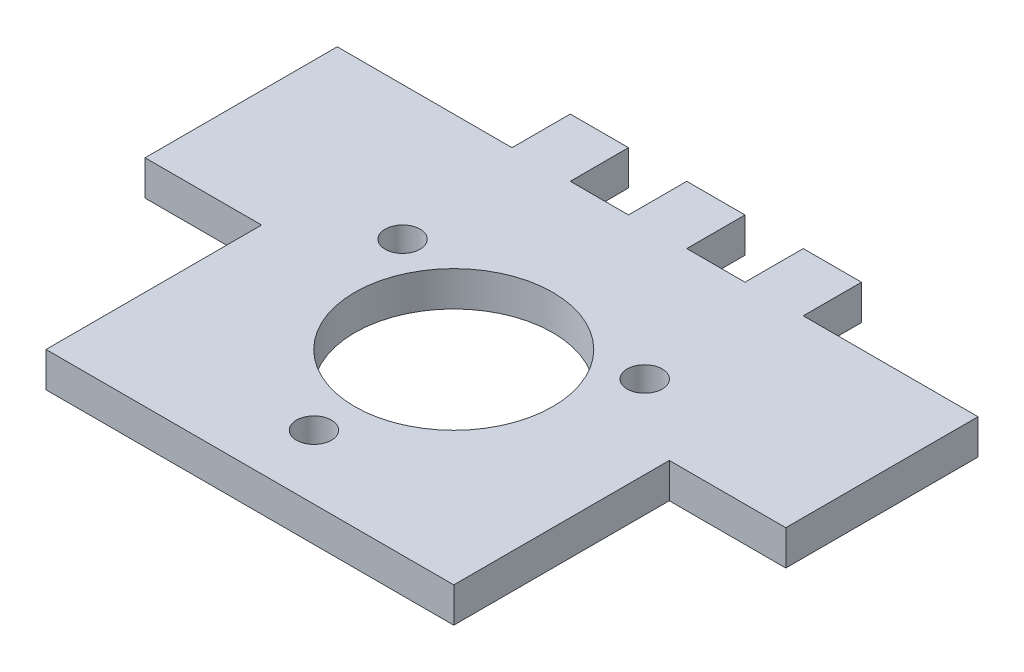
ISO-10303-21;
HEADER;
FILE_DESCRIPTION(('STEP AP214'),'2;1');
FILE_NAME('part.step','',(''),(''),'','','');
FILE_SCHEMA(('AUTOMOTIVE_DESIGN { 1 0 10303 214 1 1 1 1 }'));
ENDSEC;
DATA;
#1=APPLICATION_CONTEXT('core data for automotive mechanical design processes');
#2=APPLICATION_PROTOCOL_DEFINITION('international standard','automotive_design',2000,#1);
#3=PRODUCT_CONTEXT('',#1,'mechanical');
#4=PRODUCT('Part','Part','',(#3));
#5=PRODUCT_RELATED_PRODUCT_CATEGORY('part','',(#4));
#6=PRODUCT_DEFINITION_FORMATION('','',#4);
#7=PRODUCT_DEFINITION_CONTEXT('part definition',#1,'design');
#8=PRODUCT_DEFINITION('design','',#6,#7);
#9=PRODUCT_DEFINITION_SHAPE('','',#8);
#10=(LENGTH_UNIT() NAMED_UNIT(*) SI_UNIT(.MILLI.,.METRE.));
#11=(NAMED_UNIT(*) PLANE_ANGLE_UNIT() SI_UNIT($,.RADIAN.));
#12=(NAMED_UNIT(*) SI_UNIT($,.STERADIAN.) SOLID_ANGLE_UNIT());
#13=UNCERTAINTY_MEASURE_WITH_UNIT(LENGTH_MEASURE(1.E-05),#10,'distance_accuracy_value','');
#14=(GEOMETRIC_REPRESENTATION_CONTEXT(3) GLOBAL_UNCERTAINTY_ASSIGNED_CONTEXT((#13)) GLOBAL_UNIT_ASSIGNED_CONTEXT((#10,
#11,#12)) REPRESENTATION_CONTEXT('',''));
#15=CARTESIAN_POINT('',(0.,0.,0.));
#16=DIRECTION('',(0.,0.,1.));
#17=DIRECTION('',(1.,0.,0.));
#18=AXIS2_PLACEMENT_3D('',#15,#16,#17);
#19=CARTESIAN_POINT('',(-17.5,3.,-17.5));
#20=DIRECTION('',(1.,0.,0.));
#21=DIRECTION('',(0.,0.,-1.));
#22=AXIS2_PLACEMENT_3D('',#19,#20,#21);
#23=PLANE('',#22);
#24=DIRECTION('',(0.,1.,0.));
#25=VECTOR('',#24,1.);
#26=CARTESIAN_POINT('',(-17.5,-19.2937813815747,-0.999999999999997));
#27=LINE('',#26,#25);
#28=CARTESIAN_POINT('',(-17.5,0.,-0.999999999999997));
#29=VERTEX_POINT('',#28);
#30=CARTESIAN_POINT('',(-17.5,3.,-0.999999999999997));
#31=VERTEX_POINT('',#30);
#32=EDGE_CURVE('E56',#29,#31,#27,.T.);
#33=ORIENTED_EDGE('',*,*,#32,.F.);
#34=DIRECTION('',(0.,0.,1.));
#35=VECTOR('',#34,1.);
#36=CARTESIAN_POINT('',(-17.5,0.,-17.5));
#37=LINE('',#36,#35);
#38=CARTESIAN_POINT('',(-17.5,0.,17.5));
#39=VERTEX_POINT('',#38);
#40=EDGE_CURVE('E292',#29,#39,#37,.T.);
#41=ORIENTED_EDGE('',*,*,#40,.T.);
#42=DIRECTION('',(0.,-1.,0.));
#43=VECTOR('',#42,1.);
#44=CARTESIAN_POINT('',(-17.5,3.,17.5));
#45=LINE('',#44,#43);
#46=CARTESIAN_POINT('',(-17.5,3.,17.5));
#47=VERTEX_POINT('',#46);
#48=EDGE_CURVE('E11',#47,#39,#45,.T.);
#49=ORIENTED_EDGE('',*,*,#48,.F.);
#50=DIRECTION('',(0.,0.,1.));
#51=VECTOR('',#50,1.);
#52=CARTESIAN_POINT('',(-17.5,3.,-17.5));
#53=LINE('',#52,#51);
#54=EDGE_CURVE('E218',#31,#47,#53,.T.);
#55=ORIENTED_EDGE('',*,*,#54,.F.);
#56=EDGE_LOOP('',(#33,#41,#49,#55));
#57=FACE_BOUND('',#56,.T.);
#58=ADVANCED_FACE('F32',(#57),#23,.F.);
#59=CARTESIAN_POINT('',(-17.5,3.,-17.5));
#60=DIRECTION('',(0.,0.,1.));
#61=DIRECTION('',(1.,0.,0.));
#62=AXIS2_PLACEMENT_3D('',#59,#60,#61);
#63=PLANE('',#62);
#64=DIRECTION('',(-1.,0.,0.));
#65=VECTOR('',#64,1.);
#66=CARTESIAN_POINT('',(-17.5,3.,-17.5));
#67=LINE('',#66,#65);
#68=CARTESIAN_POINT('',(7.49999999999999,3.,-17.5));
#69=VERTEX_POINT('',#68);
#70=CARTESIAN_POINT('',(2.5,3.,-17.5));
#71=VERTEX_POINT('',#70);
#72=EDGE_CURVE('E257',#69,#71,#67,.T.);
#73=ORIENTED_EDGE('',*,*,#72,.F.);
#74=DIRECTION('',(0.,1.,0.));
#75=VECTOR('',#74,1.);
#76=CARTESIAN_POINT('',(7.49999999999999,0.,-17.5));
#77=LINE('',#76,#75);
#78=CARTESIAN_POINT('',(7.49999999999999,0.,-17.5));
#79=VERTEX_POINT('',#78);
#80=EDGE_CURVE('E377',#79,#69,#77,.T.);
#81=ORIENTED_EDGE('',*,*,#80,.F.);
#82=DIRECTION('',(-1.,0.,0.));
#83=VECTOR('',#82,1.);
#84=CARTESIAN_POINT('',(-17.5,0.,-17.5));
#85=LINE('',#84,#83);
#86=CARTESIAN_POINT('',(2.5,0.,-17.5));
#87=VERTEX_POINT('',#86);
#88=EDGE_CURVE('E252',#79,#87,#85,.T.);
#89=ORIENTED_EDGE('',*,*,#88,.T.);
#90=DIRECTION('',(0.,1.,0.));
#91=VECTOR('',#90,1.);
#92=CARTESIAN_POINT('',(2.49999999999999,0.,-17.5));
#93=LINE('',#92,#91);
#94=EDGE_CURVE('E340',#87,#71,#93,.T.);
#95=ORIENTED_EDGE('',*,*,#94,.T.);
#96=EDGE_LOOP('',(#73,#81,#89,#95));
#97=FACE_BOUND('',#96,.T.);
#98=ADVANCED_FACE('F374',(#97),#63,.F.);
#99=CARTESIAN_POINT('',(-2.50000000000001,3.,-17.5));
#100=VERTEX_POINT('',#99);
#101=CARTESIAN_POINT('',(-7.50000000000001,3.,-17.5));
#102=VERTEX_POINT('',#101);
#103=EDGE_CURVE('E255',#100,#102,#67,.T.);
#104=ORIENTED_EDGE('',*,*,#103,.F.);
#105=DIRECTION('',(0.,1.,0.));
#106=VECTOR('',#105,1.);
#107=CARTESIAN_POINT('',(-2.50000000000001,0.,-17.5));
#108=LINE('',#107,#106);
#109=CARTESIAN_POINT('',(-2.50000000000001,0.,-17.5));
#110=VERTEX_POINT('',#109);
#111=EDGE_CURVE('E347',#110,#100,#108,.T.);
#112=ORIENTED_EDGE('',*,*,#111,.F.);
#113=CARTESIAN_POINT('',(-7.50000000000001,0.,-17.5));
#114=VERTEX_POINT('',#113);
#115=EDGE_CURVE('E249',#110,#114,#85,.T.);
#116=ORIENTED_EDGE('',*,*,#115,.T.);
#117=DIRECTION('',(0.,1.,0.));
#118=VECTOR('',#117,1.);
#119=CARTESIAN_POINT('',(-7.50000000000001,0.,-17.5));
#120=LINE('',#119,#118);
#121=EDGE_CURVE('E302',#114,#102,#120,.T.);
#122=ORIENTED_EDGE('',*,*,#121,.T.);
#123=EDGE_LOOP('',(#104,#112,#116,#122));
#124=FACE_BOUND('',#123,.T.);
#125=ADVANCED_FACE('F417',(#124),#63,.F.);
#126=DIRECTION('',(0.,1.,0.));
#127=VECTOR('',#126,1.);
#128=CARTESIAN_POINT('',(-12.5,0.,-17.5));
#129=LINE('',#128,#127);
#130=CARTESIAN_POINT('',(-12.5,0.,-17.5));
#131=VERTEX_POINT('',#130);
#132=CARTESIAN_POINT('',(-12.5,3.,-17.5));
#133=VERTEX_POINT('',#132);
#134=EDGE_CURVE('E315',#131,#133,#129,.T.);
#135=ORIENTED_EDGE('',*,*,#134,.F.);
#136=CARTESIAN_POINT('',(-27.5,0.,-17.5));
#137=VERTEX_POINT('',#136);
#138=EDGE_CURVE('E232',#131,#137,#85,.T.);
#139=ORIENTED_EDGE('',*,*,#138,.T.);
#140=DIRECTION('',(0.,1.,0.));
#141=VECTOR('',#140,1.);
#142=CARTESIAN_POINT('',(-27.5,-19.2937813815747,-17.5));
#143=LINE('',#142,#141);
#144=CARTESIAN_POINT('',(-27.5,3.,-17.5));
#145=VERTEX_POINT('',#144);
#146=EDGE_CURVE('E223',#137,#145,#143,.T.);
#147=ORIENTED_EDGE('',*,*,#146,.T.);
#148=EDGE_CURVE('E258',#133,#145,#67,.T.);
#149=ORIENTED_EDGE('',*,*,#148,.F.);
#150=EDGE_LOOP('',(#135,#139,#147,#149));
#151=FACE_BOUND('',#150,.T.);
#152=ADVANCED_FACE('F361',(#151),#63,.F.);
#153=CARTESIAN_POINT('',(-17.5,3.,17.5));
#154=DIRECTION('',(0.,0.,-1.));
#155=DIRECTION('',(-1.,0.,0.));
#156=AXIS2_PLACEMENT_3D('',#153,#154,#155);
#157=PLANE('',#156);
#158=DIRECTION('',(1.,0.,0.));
#159=VECTOR('',#158,1.);
#160=CARTESIAN_POINT('',(-17.5,0.,17.5));
#161=LINE('',#160,#159);
#162=CARTESIAN_POINT('',(17.5,0.,17.5));
#163=VERTEX_POINT('',#162);
#164=EDGE_CURVE('E233',#39,#163,#161,.T.);
#165=ORIENTED_EDGE('',*,*,#164,.T.);
#166=DIRECTION('',(0.,-1.,0.));
#167=VECTOR('',#166,1.);
#168=CARTESIAN_POINT('',(17.5,3.,17.5));
#169=LINE('',#168,#167);
#170=CARTESIAN_POINT('',(17.5,3.,17.5));
#171=VERTEX_POINT('',#170);
#172=EDGE_CURVE('E40',#171,#163,#169,.T.);
#173=ORIENTED_EDGE('',*,*,#172,.F.);
#174=DIRECTION('',(1.,0.,0.));
#175=VECTOR('',#174,1.);
#176=CARTESIAN_POINT('',(-17.5,3.,17.5));
#177=LINE('',#176,#175);
#178=EDGE_CURVE('E365',#47,#171,#177,.T.);
#179=ORIENTED_EDGE('',*,*,#178,.F.);
#180=ORIENTED_EDGE('',*,*,#48,.T.);
#181=EDGE_LOOP('',(#165,#173,#179,#180));
#182=FACE_BOUND('',#181,.T.);
#183=ADVANCED_FACE('F434',(#182),#157,.F.);
#184=CARTESIAN_POINT('',(17.5,3.,-17.5));
#185=DIRECTION('',(-1.,0.,0.));
#186=DIRECTION('',(0.,0.,1.));
#187=AXIS2_PLACEMENT_3D('',#184,#185,#186);
#188=PLANE('',#187);
#189=DIRECTION('',(0.,0.,-1.));
#190=VECTOR('',#189,1.);
#191=CARTESIAN_POINT('',(17.5,0.,-17.5));
#192=LINE('',#191,#190);
#193=CARTESIAN_POINT('',(17.5,0.,-0.999999999999997));
#194=VERTEX_POINT('',#193);
#195=EDGE_CURVE('E229',#163,#194,#192,.T.);
#196=ORIENTED_EDGE('',*,*,#195,.T.);
#197=DIRECTION('',(0.,1.,0.));
#198=VECTOR('',#197,1.);
#199=CARTESIAN_POINT('',(17.5,-19.2937813815747,-0.999999999999997));
#200=LINE('',#199,#198);
#201=CARTESIAN_POINT('',(17.5,3.,-0.999999999999997));
#202=VERTEX_POINT('',#201);
#203=EDGE_CURVE('E177',#194,#202,#200,.T.);
#204=ORIENTED_EDGE('',*,*,#203,.T.);
#205=DIRECTION('',(0.,0.,-1.));
#206=VECTOR('',#205,1.);
#207=CARTESIAN_POINT('',(17.5,3.,-17.5));
#208=LINE('',#207,#206);
#209=EDGE_CURVE('E190',#171,#202,#208,.T.);
#210=ORIENTED_EDGE('',*,*,#209,.F.);
#211=ORIENTED_EDGE('',*,*,#172,.T.);
#212=EDGE_LOOP('',(#196,#204,#210,#211));
#213=FACE_BOUND('',#212,.T.);
#214=ADVANCED_FACE('F427',(#213),#188,.F.);
#215=CARTESIAN_POINT('',(27.5,0.,-17.5));
#216=VERTEX_POINT('',#215);
#217=CARTESIAN_POINT('',(12.5,0.,-17.5));
#218=VERTEX_POINT('',#217);
#219=EDGE_CURVE('E247',#216,#218,#85,.T.);
#220=ORIENTED_EDGE('',*,*,#219,.T.);
#221=DIRECTION('',(0.,1.,0.));
#222=VECTOR('',#221,1.);
#223=CARTESIAN_POINT('',(12.5,0.,-17.5));
#224=LINE('',#223,#222);
#225=CARTESIAN_POINT('',(12.5,3.,-17.5));
#226=VERTEX_POINT('',#225);
#227=EDGE_CURVE('E449',#218,#226,#224,.T.);
#228=ORIENTED_EDGE('',*,*,#227,.T.);
#229=CARTESIAN_POINT('',(27.5,3.,-17.5));
#230=VERTEX_POINT('',#229);
#231=EDGE_CURVE('E269',#230,#226,#67,.T.);
#232=ORIENTED_EDGE('',*,*,#231,.F.);
#233=DIRECTION('',(0.,1.,0.));
#234=VECTOR('',#233,1.);
#235=CARTESIAN_POINT('',(27.5,-19.2937813815747,-17.5));
#236=LINE('',#235,#234);
#237=EDGE_CURVE('E176',#216,#230,#236,.T.);
#238=ORIENTED_EDGE('',*,*,#237,.F.);
#239=EDGE_LOOP('',(#220,#228,#232,#238));
#240=FACE_BOUND('',#239,.T.);
#241=ADVANCED_FACE('F419',(#240),#63,.F.);
#242=CARTESIAN_POINT('',(0.,3.,0.));
#243=DIRECTION('',(0.,1.,0.));
#244=DIRECTION('',(0.,0.,1.));
#245=AXIS2_PLACEMENT_3D('',#242,#243,#244);
#246=PLANE('',#245);
#247=CARTESIAN_POINT('',(10.3923048454139,3.,-5.99999999999964));
#248=DIRECTION('',(0.,1.,0.));
#249=DIRECTION('',(0.,0.,1.));
#250=AXIS2_PLACEMENT_3D('',#247,#248,#249);
#251=CIRCLE('',#250,1.5);
#252=CARTESIAN_POINT('',(10.3923048454139,3.,-4.49999999999964));
#253=VERTEX_POINT('',#252);
#254=EDGE_CURVE('E227',#253,#253,#251,.T.);
#255=ORIENTED_EDGE('',*,*,#254,.F.);
#256=EDGE_LOOP('',(#255));
#257=FACE_BOUND('',#256,.T.);
#258=CARTESIAN_POINT('',(-10.3923048454126,3.,-6.00000000000037));
#259=DIRECTION('',(0.,1.,0.));
#260=DIRECTION('',(0.,0.,1.));
#261=AXIS2_PLACEMENT_3D('',#258,#259,#260);
#262=CIRCLE('',#261,1.5);
#263=CARTESIAN_POINT('',(-10.3923048454126,3.,-4.50000000000036));
#264=VERTEX_POINT('',#263);
#265=EDGE_CURVE('E289',#264,#264,#262,.T.);
#266=ORIENTED_EDGE('',*,*,#265,.F.);
#267=EDGE_LOOP('',(#266));
#268=FACE_BOUND('',#267,.T.);
#269=CARTESIAN_POINT('',(0.,3.,12.));
#270=DIRECTION('',(0.,1.,0.));
#271=DIRECTION('',(0.,0.,1.));
#272=AXIS2_PLACEMENT_3D('',#269,#270,#271);
#273=CIRCLE('',#272,1.5);
#274=CARTESIAN_POINT('',(0.,3.,13.5));
#275=VERTEX_POINT('',#274);
#276=EDGE_CURVE('E285',#275,#275,#273,.T.);
#277=ORIENTED_EDGE('',*,*,#276,.F.);
#278=EDGE_LOOP('',(#277));
#279=FACE_BOUND('',#278,.T.);
#280=CARTESIAN_POINT('',(0.,3.,0.));
#281=DIRECTION('',(0.,1.,0.));
#282=DIRECTION('',(0.,0.,1.));
#283=AXIS2_PLACEMENT_3D('',#280,#281,#282);
#284=CIRCLE('',#283,8.5);
#285=CARTESIAN_POINT('',(0.,3.,8.5));
#286=VERTEX_POINT('',#285);
#287=EDGE_CURVE('E281',#286,#286,#284,.T.);
#288=ORIENTED_EDGE('',*,*,#287,.F.);
#289=EDGE_LOOP('',(#288));
#290=FACE_BOUND('',#289,.T.);
#291=ORIENTED_EDGE('',*,*,#148,.T.);
#292=DIRECTION('',(0.,0.,1.));
#293=VECTOR('',#292,1.);
#294=CARTESIAN_POINT('',(-27.5,3.,-17.5));
#295=LINE('',#294,#293);
#296=CARTESIAN_POINT('',(-27.5,3.,-0.999999999999996));
#297=VERTEX_POINT('',#296);
#298=EDGE_CURVE('E206',#145,#297,#295,.T.);
#299=ORIENTED_EDGE('',*,*,#298,.T.);
#300=DIRECTION('',(1.,0.,0.));
#301=VECTOR('',#300,1.);
#302=CARTESIAN_POINT('',(-17.5,3.,-0.999999999999997));
#303=LINE('',#302,#301);
#304=EDGE_CURVE('E209',#297,#31,#303,.T.);
#305=ORIENTED_EDGE('',*,*,#304,.T.);
#306=ORIENTED_EDGE('',*,*,#54,.T.);
#307=ORIENTED_EDGE('',*,*,#178,.T.);
#308=ORIENTED_EDGE('',*,*,#209,.T.);
#309=DIRECTION('',(-1.,0.,0.));
#310=VECTOR('',#309,1.);
#311=CARTESIAN_POINT('',(17.5,3.,-0.999999999999997));
#312=LINE('',#311,#310);
#313=CARTESIAN_POINT('',(27.5,3.,-0.999999999999996));
#314=VERTEX_POINT('',#313);
#315=EDGE_CURVE('E48',#314,#202,#312,.T.);
#316=ORIENTED_EDGE('',*,*,#315,.F.);
#317=DIRECTION('',(0.,0.,1.));
#318=VECTOR('',#317,1.);
#319=CARTESIAN_POINT('',(27.5,3.,-17.5));
#320=LINE('',#319,#318);
#321=EDGE_CURVE('E181',#230,#314,#320,.T.);
#322=ORIENTED_EDGE('',*,*,#321,.F.);
#323=ORIENTED_EDGE('',*,*,#231,.T.);
#324=DIRECTION('',(0.,0.,-1.));
#325=VECTOR('',#324,1.);
#326=CARTESIAN_POINT('',(12.5,3.,-17.5));
#327=LINE('',#326,#325);
#328=CARTESIAN_POINT('',(12.5,3.,-22.5));
#329=VERTEX_POINT('',#328);
#330=EDGE_CURVE('E461',#226,#329,#327,.T.);
#331=ORIENTED_EDGE('',*,*,#330,.T.);
#332=DIRECTION('',(-1.,0.,0.));
#333=VECTOR('',#332,1.);
#334=CARTESIAN_POINT('',(7.49999999999999,3.,-22.5));
#335=LINE('',#334,#333);
#336=CARTESIAN_POINT('',(7.49999999999999,3.,-22.5));
#337=VERTEX_POINT('',#336);
#338=EDGE_CURVE('E457',#329,#337,#335,.T.);
#339=ORIENTED_EDGE('',*,*,#338,.T.);
#340=DIRECTION('',(0.,0.,1.));
#341=VECTOR('',#340,1.);
#342=CARTESIAN_POINT('',(7.49999999999999,3.,-17.5));
#343=LINE('',#342,#341);
#344=EDGE_CURVE('E280',#337,#69,#343,.T.);
#345=ORIENTED_EDGE('',*,*,#344,.T.);
#346=ORIENTED_EDGE('',*,*,#72,.T.);
#347=DIRECTION('',(0.,0.,-1.));
#348=VECTOR('',#347,1.);
#349=CARTESIAN_POINT('',(2.49999999999999,3.,-17.5));
#350=LINE('',#349,#348);
#351=CARTESIAN_POINT('',(2.49999999999999,3.,-22.5));
#352=VERTEX_POINT('',#351);
#353=EDGE_CURVE('E386',#71,#352,#350,.T.);
#354=ORIENTED_EDGE('',*,*,#353,.T.);
#355=DIRECTION('',(-1.,0.,0.));
#356=VECTOR('',#355,1.);
#357=CARTESIAN_POINT('',(-2.50000000000001,3.,-22.5));
#358=LINE('',#357,#356);
#359=CARTESIAN_POINT('',(-2.50000000000001,3.,-22.5));
#360=VERTEX_POINT('',#359);
#361=EDGE_CURVE('E343',#352,#360,#358,.T.);
#362=ORIENTED_EDGE('',*,*,#361,.T.);
#363=DIRECTION('',(0.,0.,1.));
#364=VECTOR('',#363,1.);
#365=CARTESIAN_POINT('',(-2.50000000000001,3.,-17.5));
#366=LINE('',#365,#364);
#367=EDGE_CURVE('E395',#360,#100,#366,.T.);
#368=ORIENTED_EDGE('',*,*,#367,.T.);
#369=ORIENTED_EDGE('',*,*,#103,.T.);
#370=DIRECTION('',(0.,0.,-1.));
#371=VECTOR('',#370,1.);
#372=CARTESIAN_POINT('',(-7.50000000000001,3.,-17.5));
#373=LINE('',#372,#371);
#374=CARTESIAN_POINT('',(-7.50000000000001,3.,-22.5));
#375=VERTEX_POINT('',#374);
#376=EDGE_CURVE('E329',#102,#375,#373,.T.);
#377=ORIENTED_EDGE('',*,*,#376,.T.);
#378=DIRECTION('',(-1.,0.,0.));
#379=VECTOR('',#378,1.);
#380=CARTESIAN_POINT('',(-12.5,3.,-22.5));
#381=LINE('',#380,#379);
#382=CARTESIAN_POINT('',(-12.5,3.,-22.5));
#383=VERTEX_POINT('',#382);
#384=EDGE_CURVE('E305',#375,#383,#381,.T.);
#385=ORIENTED_EDGE('',*,*,#384,.T.);
#386=DIRECTION('',(0.,0.,1.));
#387=VECTOR('',#386,1.);
#388=CARTESIAN_POINT('',(-12.5,3.,-17.5));
#389=LINE('',#388,#387);
#390=EDGE_CURVE('E327',#383,#133,#389,.T.);
#391=ORIENTED_EDGE('',*,*,#390,.T.);
#392=EDGE_LOOP('',(#291,#299,#305,#306,#307,#308,#316,#322,#323,#331,#339,#345,#346,#354,#362,
#368,#369,#377,#385,#391));
#393=FACE_BOUND('',#392,.T.);
#394=ADVANCED_FACE('F188',(#257,#268,#279,#290,#393),#246,.T.);
#395=CARTESIAN_POINT('',(0.,0.,0.));
#396=DIRECTION('',(0.,1.,0.));
#397=DIRECTION('',(0.,0.,1.));
#398=AXIS2_PLACEMENT_3D('',#395,#396,#397);
#399=PLANE('',#398);
#400=CARTESIAN_POINT('',(10.3923048454139,0.,-5.99999999999964));
#401=DIRECTION('',(0.,1.,0.));
#402=DIRECTION('',(0.,0.,1.));
#403=AXIS2_PLACEMENT_3D('',#400,#401,#402);
#404=CIRCLE('',#403,1.5);
#405=CARTESIAN_POINT('',(10.3923048454139,0.,-4.49999999999964));
#406=VERTEX_POINT('',#405);
#407=EDGE_CURVE('E290',#406,#406,#404,.T.);
#408=ORIENTED_EDGE('',*,*,#407,.T.);
#409=EDGE_LOOP('',(#408));
#410=FACE_BOUND('',#409,.T.);
#411=CARTESIAN_POINT('',(-10.3923048454126,0.,-6.00000000000037));
#412=DIRECTION('',(0.,1.,0.));
#413=DIRECTION('',(0.,0.,1.));
#414=AXIS2_PLACEMENT_3D('',#411,#412,#413);
#415=CIRCLE('',#414,1.5);
#416=CARTESIAN_POINT('',(-10.3923048454126,0.,-4.50000000000036));
#417=VERTEX_POINT('',#416);
#418=EDGE_CURVE('E286',#417,#417,#415,.T.);
#419=ORIENTED_EDGE('',*,*,#418,.T.);
#420=EDGE_LOOP('',(#419));
#421=FACE_BOUND('',#420,.T.);
#422=CARTESIAN_POINT('',(0.,0.,12.));
#423=DIRECTION('',(0.,1.,0.));
#424=DIRECTION('',(0.,0.,1.));
#425=AXIS2_PLACEMENT_3D('',#422,#423,#424);
#426=CIRCLE('',#425,1.5);
#427=CARTESIAN_POINT('',(0.,0.,13.5));
#428=VERTEX_POINT('',#427);
#429=EDGE_CURVE('E282',#428,#428,#426,.T.);
#430=ORIENTED_EDGE('',*,*,#429,.T.);
#431=EDGE_LOOP('',(#430));
#432=FACE_BOUND('',#431,.T.);
#433=CARTESIAN_POINT('',(0.,0.,0.));
#434=DIRECTION('',(0.,1.,0.));
#435=DIRECTION('',(0.,0.,1.));
#436=AXIS2_PLACEMENT_3D('',#433,#434,#435);
#437=CIRCLE('',#436,8.5);
#438=CARTESIAN_POINT('',(0.,0.,8.5));
#439=VERTEX_POINT('',#438);
#440=EDGE_CURVE('E277',#439,#439,#437,.T.);
#441=ORIENTED_EDGE('',*,*,#440,.T.);
#442=EDGE_LOOP('',(#441));
#443=FACE_BOUND('',#442,.T.);
#444=ORIENTED_EDGE('',*,*,#40,.F.);
#445=DIRECTION('',(-1.,0.,0.));
#446=VECTOR('',#445,1.);
#447=CARTESIAN_POINT('',(-17.5,0.,-0.999999999999997));
#448=LINE('',#447,#446);
#449=CARTESIAN_POINT('',(-27.5,0.,-0.999999999999997));
#450=VERTEX_POINT('',#449);
#451=EDGE_CURVE('E205',#29,#450,#448,.T.);
#452=ORIENTED_EDGE('',*,*,#451,.T.);
#453=DIRECTION('',(0.,0.,-1.));
#454=VECTOR('',#453,1.);
#455=CARTESIAN_POINT('',(-27.5,0.,-17.5));
#456=LINE('',#455,#454);
#457=EDGE_CURVE('E202',#450,#137,#456,.T.);
#458=ORIENTED_EDGE('',*,*,#457,.T.);
#459=ORIENTED_EDGE('',*,*,#138,.F.);
#460=DIRECTION('',(0.,0.,1.));
#461=VECTOR('',#460,1.);
#462=CARTESIAN_POINT('',(-12.5,0.,-17.5));
#463=LINE('',#462,#461);
#464=CARTESIAN_POINT('',(-12.5,0.,-22.5));
#465=VERTEX_POINT('',#464);
#466=EDGE_CURVE('E321',#465,#131,#463,.T.);
#467=ORIENTED_EDGE('',*,*,#466,.F.);
#468=DIRECTION('',(-1.,0.,0.));
#469=VECTOR('',#468,1.);
#470=CARTESIAN_POINT('',(-12.5,0.,-22.5));
#471=LINE('',#470,#469);
#472=CARTESIAN_POINT('',(-7.50000000000001,0.,-22.5));
#473=VERTEX_POINT('',#472);
#474=EDGE_CURVE('E320',#473,#465,#471,.T.);
#475=ORIENTED_EDGE('',*,*,#474,.F.);
#476=DIRECTION('',(0.,0.,-1.));
#477=VECTOR('',#476,1.);
#478=CARTESIAN_POINT('',(-7.50000000000001,0.,-17.5));
#479=LINE('',#478,#477);
#480=EDGE_CURVE('E317',#114,#473,#479,.T.);
#481=ORIENTED_EDGE('',*,*,#480,.F.);
#482=ORIENTED_EDGE('',*,*,#115,.F.);
#483=DIRECTION('',(0.,0.,1.));
#484=VECTOR('',#483,1.);
#485=CARTESIAN_POINT('',(-2.50000000000001,0.,-17.5));
#486=LINE('',#485,#484);
#487=CARTESIAN_POINT('',(-2.50000000000001,0.,-22.5));
#488=VERTEX_POINT('',#487);
#489=EDGE_CURVE('E388',#488,#110,#486,.T.);
#490=ORIENTED_EDGE('',*,*,#489,.F.);
#491=DIRECTION('',(-1.,0.,0.));
#492=VECTOR('',#491,1.);
#493=CARTESIAN_POINT('',(-2.50000000000001,0.,-22.5));
#494=LINE('',#493,#492);
#495=CARTESIAN_POINT('',(2.49999999999999,0.,-22.5));
#496=VERTEX_POINT('',#495);
#497=EDGE_CURVE('E349',#496,#488,#494,.T.);
#498=ORIENTED_EDGE('',*,*,#497,.F.);
#499=DIRECTION('',(0.,0.,-1.));
#500=VECTOR('',#499,1.);
#501=CARTESIAN_POINT('',(2.49999999999999,0.,-17.5));
#502=LINE('',#501,#500);
#503=EDGE_CURVE('E384',#87,#496,#502,.T.);
#504=ORIENTED_EDGE('',*,*,#503,.F.);
#505=ORIENTED_EDGE('',*,*,#88,.F.);
#506=DIRECTION('',(0.,0.,1.));
#507=VECTOR('',#506,1.);
#508=CARTESIAN_POINT('',(7.49999999999999,0.,-17.5));
#509=LINE('',#508,#507);
#510=CARTESIAN_POINT('',(7.49999999999999,0.,-22.5));
#511=VERTEX_POINT('',#510);
#512=EDGE_CURVE('E460',#511,#79,#509,.T.);
#513=ORIENTED_EDGE('',*,*,#512,.F.);
#514=DIRECTION('',(-1.,0.,0.));
#515=VECTOR('',#514,1.);
#516=CARTESIAN_POINT('',(7.49999999999999,0.,-22.5));
#517=LINE('',#516,#515);
#518=CARTESIAN_POINT('',(12.5,0.,-22.5));
#519=VERTEX_POINT('',#518);
#520=EDGE_CURVE('E454',#519,#511,#517,.T.);
#521=ORIENTED_EDGE('',*,*,#520,.F.);
#522=DIRECTION('',(0.,0.,-1.));
#523=VECTOR('',#522,1.);
#524=CARTESIAN_POINT('',(12.5,0.,-17.5));
#525=LINE('',#524,#523);
#526=EDGE_CURVE('E448',#218,#519,#525,.T.);
#527=ORIENTED_EDGE('',*,*,#526,.F.);
#528=ORIENTED_EDGE('',*,*,#219,.F.);
#529=DIRECTION('',(0.,0.,-1.));
#530=VECTOR('',#529,1.);
#531=CARTESIAN_POINT('',(27.5,0.,-17.5));
#532=LINE('',#531,#530);
#533=CARTESIAN_POINT('',(27.5,0.,-0.999999999999996));
#534=VERTEX_POINT('',#533);
#535=EDGE_CURVE('E210',#534,#216,#532,.T.);
#536=ORIENTED_EDGE('',*,*,#535,.F.);
#537=DIRECTION('',(1.,0.,0.));
#538=VECTOR('',#537,1.);
#539=CARTESIAN_POINT('',(17.5,0.,-0.999999999999997));
#540=LINE('',#539,#538);
#541=EDGE_CURVE('E173',#194,#534,#540,.T.);
#542=ORIENTED_EDGE('',*,*,#541,.F.);
#543=ORIENTED_EDGE('',*,*,#195,.F.);
#544=ORIENTED_EDGE('',*,*,#164,.F.);
#545=EDGE_LOOP('',(#444,#452,#458,#459,#467,#475,#481,#482,#490,#498,#504,#505,#513,#521,#527,
#528,#536,#542,#543,#544));
#546=FACE_BOUND('',#545,.T.);
#547=ADVANCED_FACE('F355',(#410,#421,#432,#443,#546),#399,.F.);
#548=CARTESIAN_POINT('',(-12.5,0.,-17.5));
#549=DIRECTION('',(-1.,0.,0.));
#550=DIRECTION('',(0.,0.,1.));
#551=AXIS2_PLACEMENT_3D('',#548,#549,#550);
#552=PLANE('',#551);
#553=ORIENTED_EDGE('',*,*,#390,.F.);
#554=DIRECTION('',(0.,1.,0.));
#555=VECTOR('',#554,1.);
#556=CARTESIAN_POINT('',(-12.5,0.,-22.5));
#557=LINE('',#556,#555);
#558=EDGE_CURVE('E293',#465,#383,#557,.T.);
#559=ORIENTED_EDGE('',*,*,#558,.F.);
#560=ORIENTED_EDGE('',*,*,#466,.T.);
#561=ORIENTED_EDGE('',*,*,#134,.T.);
#562=EDGE_LOOP('',(#553,#559,#560,#561));
#563=FACE_BOUND('',#562,.T.);
#564=ADVANCED_FACE('F359',(#563),#552,.T.);
#565=CARTESIAN_POINT('',(-12.5,0.,-22.5));
#566=DIRECTION('',(0.,0.,-1.));
#567=DIRECTION('',(-1.,0.,0.));
#568=AXIS2_PLACEMENT_3D('',#565,#566,#567);
#569=PLANE('',#568);
#570=ORIENTED_EDGE('',*,*,#384,.F.);
#571=DIRECTION('',(0.,1.,0.));
#572=VECTOR('',#571,1.);
#573=CARTESIAN_POINT('',(-7.50000000000001,0.,-22.5));
#574=LINE('',#573,#572);
#575=EDGE_CURVE('E296',#473,#375,#574,.T.);
#576=ORIENTED_EDGE('',*,*,#575,.F.);
#577=ORIENTED_EDGE('',*,*,#474,.T.);
#578=ORIENTED_EDGE('',*,*,#558,.T.);
#579=EDGE_LOOP('',(#570,#576,#577,#578));
#580=FACE_BOUND('',#579,.T.);
#581=ADVANCED_FACE('F351',(#580),#569,.T.);
#582=CARTESIAN_POINT('',(-7.50000000000001,0.,-17.5));
#583=DIRECTION('',(1.,0.,0.));
#584=DIRECTION('',(0.,0.,-1.));
#585=AXIS2_PLACEMENT_3D('',#582,#583,#584);
#586=PLANE('',#585);
#587=ORIENTED_EDGE('',*,*,#376,.F.);
#588=ORIENTED_EDGE('',*,*,#121,.F.);
#589=ORIENTED_EDGE('',*,*,#480,.T.);
#590=ORIENTED_EDGE('',*,*,#575,.T.);
#591=EDGE_LOOP('',(#587,#588,#589,#590));
#592=FACE_BOUND('',#591,.T.);
#593=ADVANCED_FACE('F409',(#592),#586,.T.);
#594=CARTESIAN_POINT('',(-2.50000000000001,0.,-17.5));
#595=DIRECTION('',(-1.,0.,0.));
#596=DIRECTION('',(0.,0.,1.));
#597=AXIS2_PLACEMENT_3D('',#594,#595,#596);
#598=PLANE('',#597);
#599=ORIENTED_EDGE('',*,*,#367,.F.);
#600=DIRECTION('',(0.,1.,0.));
#601=VECTOR('',#600,1.);
#602=CARTESIAN_POINT('',(-2.50000000000001,0.,-22.5));
#603=LINE('',#602,#601);
#604=EDGE_CURVE('E330',#488,#360,#603,.T.);
#605=ORIENTED_EDGE('',*,*,#604,.F.);
#606=ORIENTED_EDGE('',*,*,#489,.T.);
#607=ORIENTED_EDGE('',*,*,#111,.T.);
#608=EDGE_LOOP('',(#599,#605,#606,#607));
#609=FACE_BOUND('',#608,.T.);
#610=ADVANCED_FACE('F401',(#609),#598,.T.);
#611=CARTESIAN_POINT('',(-2.50000000000001,0.,-22.5));
#612=DIRECTION('',(0.,0.,-1.));
#613=DIRECTION('',(-1.,0.,0.));
#614=AXIS2_PLACEMENT_3D('',#611,#612,#613);
#615=PLANE('',#614);
#616=ORIENTED_EDGE('',*,*,#361,.F.);
#617=DIRECTION('',(0.,1.,0.));
#618=VECTOR('',#617,1.);
#619=CARTESIAN_POINT('',(2.49999999999999,0.,-22.5));
#620=LINE('',#619,#618);
#621=EDGE_CURVE('E334',#496,#352,#620,.T.);
#622=ORIENTED_EDGE('',*,*,#621,.F.);
#623=ORIENTED_EDGE('',*,*,#497,.T.);
#624=ORIENTED_EDGE('',*,*,#604,.T.);
#625=EDGE_LOOP('',(#616,#622,#623,#624));
#626=FACE_BOUND('',#625,.T.);
#627=ADVANCED_FACE('F399',(#626),#615,.T.);
#628=CARTESIAN_POINT('',(2.49999999999999,0.,-17.5));
#629=DIRECTION('',(1.,0.,0.));
#630=DIRECTION('',(0.,0.,-1.));
#631=AXIS2_PLACEMENT_3D('',#628,#629,#630);
#632=PLANE('',#631);
#633=ORIENTED_EDGE('',*,*,#353,.F.);
#634=ORIENTED_EDGE('',*,*,#94,.F.);
#635=ORIENTED_EDGE('',*,*,#503,.T.);
#636=ORIENTED_EDGE('',*,*,#621,.T.);
#637=EDGE_LOOP('',(#633,#634,#635,#636));
#638=FACE_BOUND('',#637,.T.);
#639=ADVANCED_FACE('F383',(#638),#632,.T.);
#640=CARTESIAN_POINT('',(7.49999999999999,0.,-17.5));
#641=DIRECTION('',(-1.,0.,0.));
#642=DIRECTION('',(0.,0.,1.));
#643=AXIS2_PLACEMENT_3D('',#640,#641,#642);
#644=PLANE('',#643);
#645=ORIENTED_EDGE('',*,*,#344,.F.);
#646=DIRECTION('',(0.,1.,0.));
#647=VECTOR('',#646,1.);
#648=CARTESIAN_POINT('',(7.49999999999999,0.,-22.5));
#649=LINE('',#648,#647);
#650=EDGE_CURVE('E397',#511,#337,#649,.T.);
#651=ORIENTED_EDGE('',*,*,#650,.F.);
#652=ORIENTED_EDGE('',*,*,#512,.T.);
#653=ORIENTED_EDGE('',*,*,#80,.T.);
#654=EDGE_LOOP('',(#645,#651,#652,#653));
#655=FACE_BOUND('',#654,.T.);
#656=ADVANCED_FACE('F407',(#655),#644,.T.);
#657=CARTESIAN_POINT('',(7.49999999999999,0.,-22.5));
#658=DIRECTION('',(0.,0.,-1.));
#659=DIRECTION('',(-1.,0.,0.));
#660=AXIS2_PLACEMENT_3D('',#657,#658,#659);
#661=PLANE('',#660);
#662=ORIENTED_EDGE('',*,*,#338,.F.);
#663=DIRECTION('',(0.,1.,0.));
#664=VECTOR('',#663,1.);
#665=CARTESIAN_POINT('',(12.5,0.,-22.5));
#666=LINE('',#665,#664);
#667=EDGE_CURVE('E451',#519,#329,#666,.T.);
#668=ORIENTED_EDGE('',*,*,#667,.F.);
#669=ORIENTED_EDGE('',*,*,#520,.T.);
#670=ORIENTED_EDGE('',*,*,#650,.T.);
#671=EDGE_LOOP('',(#662,#668,#669,#670));
#672=FACE_BOUND('',#671,.T.);
#673=ADVANCED_FACE('F509',(#672),#661,.T.);
#674=CARTESIAN_POINT('',(12.5,0.,-17.5));
#675=DIRECTION('',(1.,0.,0.));
#676=DIRECTION('',(0.,0.,-1.));
#677=AXIS2_PLACEMENT_3D('',#674,#675,#676);
#678=PLANE('',#677);
#679=ORIENTED_EDGE('',*,*,#330,.F.);
#680=ORIENTED_EDGE('',*,*,#227,.F.);
#681=ORIENTED_EDGE('',*,*,#526,.T.);
#682=ORIENTED_EDGE('',*,*,#667,.T.);
#683=EDGE_LOOP('',(#679,#680,#681,#682));
#684=FACE_BOUND('',#683,.T.);
#685=ADVANCED_FACE('F507',(#684),#678,.T.);
#686=CARTESIAN_POINT('',(0.,-2.,0.));
#687=DIRECTION('',(0.,1.,0.));
#688=DIRECTION('',(0.,0.,1.));
#689=AXIS2_PLACEMENT_3D('',#686,#687,#688);
#690=CYLINDRICAL_SURFACE('',#689,8.5);
#691=ORIENTED_EDGE('',*,*,#287,.T.);
#692=EDGE_LOOP('',(#691));
#693=FACE_BOUND('',#692,.T.);
#694=ORIENTED_EDGE('',*,*,#440,.F.);
#695=EDGE_LOOP('',(#694));
#696=FACE_BOUND('',#695,.T.);
#697=ADVANCED_FACE('F503',(#693,#696),#690,.F.);
#698=CARTESIAN_POINT('',(0.,-2.,12.));
#699=DIRECTION('',(0.,1.,0.));
#700=DIRECTION('',(0.,0.,1.));
#701=AXIS2_PLACEMENT_3D('',#698,#699,#700);
#702=CYLINDRICAL_SURFACE('',#701,1.5);
#703=ORIENTED_EDGE('',*,*,#276,.T.);
#704=EDGE_LOOP('',(#703));
#705=FACE_BOUND('',#704,.T.);
#706=ORIENTED_EDGE('',*,*,#429,.F.);
#707=EDGE_LOOP('',(#706));
#708=FACE_BOUND('',#707,.T.);
#709=ADVANCED_FACE('F499',(#705,#708),#702,.F.);
#710=CARTESIAN_POINT('',(-10.3923048454126,-2.,-6.00000000000037));
#711=DIRECTION('',(0.,1.,0.));
#712=DIRECTION('',(0.,0.,1.));
#713=AXIS2_PLACEMENT_3D('',#710,#711,#712);
#714=CYLINDRICAL_SURFACE('',#713,1.5);
#715=ORIENTED_EDGE('',*,*,#265,.T.);
#716=EDGE_LOOP('',(#715));
#717=FACE_BOUND('',#716,.T.);
#718=ORIENTED_EDGE('',*,*,#418,.F.);
#719=EDGE_LOOP('',(#718));
#720=FACE_BOUND('',#719,.T.);
#721=ADVANCED_FACE('F491',(#717,#720),#714,.F.);
#722=CARTESIAN_POINT('',(10.3923048454139,-2.,-5.99999999999964));
#723=DIRECTION('',(0.,1.,0.));
#724=DIRECTION('',(0.,0.,1.));
#725=AXIS2_PLACEMENT_3D('',#722,#723,#724);
#726=CYLINDRICAL_SURFACE('',#725,1.5);
#727=ORIENTED_EDGE('',*,*,#254,.T.);
#728=EDGE_LOOP('',(#727));
#729=FACE_BOUND('',#728,.T.);
#730=ORIENTED_EDGE('',*,*,#407,.F.);
#731=EDGE_LOOP('',(#730));
#732=FACE_BOUND('',#731,.T.);
#733=ADVANCED_FACE('F484',(#729,#732),#726,.F.);
#734=CARTESIAN_POINT('',(-17.5,-19.2937813815747,-0.999999999999997));
#735=DIRECTION('',(0.,0.,1.));
#736=DIRECTION('',(1.,0.,0.));
#737=AXIS2_PLACEMENT_3D('',#734,#735,#736);
#738=PLANE('',#737);
#739=ORIENTED_EDGE('',*,*,#451,.F.);
#740=ORIENTED_EDGE('',*,*,#32,.T.);
#741=ORIENTED_EDGE('',*,*,#304,.F.);
#742=DIRECTION('',(0.,1.,0.));
#743=VECTOR('',#742,1.);
#744=CARTESIAN_POINT('',(-27.5,-19.2937813815747,-0.999999999999996));
#745=LINE('',#744,#743);
#746=EDGE_CURVE('E213',#450,#297,#745,.T.);
#747=ORIENTED_EDGE('',*,*,#746,.F.);
#748=EDGE_LOOP('',(#739,#740,#741,#747));
#749=FACE_BOUND('',#748,.T.);
#750=ADVANCED_FACE('F482',(#749),#738,.T.);
#751=CARTESIAN_POINT('',(-27.5,-19.2937813815747,-17.5));
#752=DIRECTION('',(-1.,0.,0.));
#753=DIRECTION('',(0.,0.,1.));
#754=AXIS2_PLACEMENT_3D('',#751,#752,#753);
#755=PLANE('',#754);
#756=ORIENTED_EDGE('',*,*,#457,.F.);
#757=ORIENTED_EDGE('',*,*,#746,.T.);
#758=ORIENTED_EDGE('',*,*,#298,.F.);
#759=ORIENTED_EDGE('',*,*,#146,.F.);
#760=EDGE_LOOP('',(#756,#757,#758,#759));
#761=FACE_BOUND('',#760,.T.);
#762=ADVANCED_FACE('F478',(#761),#755,.T.);
#763=CARTESIAN_POINT('',(17.5,-19.2937813815747,-0.999999999999997));
#764=DIRECTION('',(0.,0.,-1.));
#765=DIRECTION('',(-1.,0.,0.));
#766=AXIS2_PLACEMENT_3D('',#763,#764,#765);
#767=PLANE('',#766);
#768=ORIENTED_EDGE('',*,*,#203,.F.);
#769=ORIENTED_EDGE('',*,*,#541,.T.);
#770=DIRECTION('',(0.,1.,0.));
#771=VECTOR('',#770,1.);
#772=CARTESIAN_POINT('',(27.5,-19.2937813815747,-0.999999999999996));
#773=LINE('',#772,#771);
#774=EDGE_CURVE('E170',#534,#314,#773,.T.);
#775=ORIENTED_EDGE('',*,*,#774,.T.);
#776=ORIENTED_EDGE('',*,*,#315,.T.);
#777=EDGE_LOOP('',(#768,#769,#775,#776));
#778=FACE_BOUND('',#777,.T.);
#779=ADVANCED_FACE('F172',(#778),#767,.F.);
#780=CARTESIAN_POINT('',(27.5,-19.2937813815747,-17.5));
#781=DIRECTION('',(-1.,0.,0.));
#782=DIRECTION('',(0.,0.,1.));
#783=AXIS2_PLACEMENT_3D('',#780,#781,#782);
#784=PLANE('',#783);
#785=ORIENTED_EDGE('',*,*,#774,.F.);
#786=ORIENTED_EDGE('',*,*,#535,.T.);
#787=ORIENTED_EDGE('',*,*,#237,.T.);
#788=ORIENTED_EDGE('',*,*,#321,.T.);
#789=EDGE_LOOP('',(#785,#786,#787,#788));
#790=FACE_BOUND('',#789,.T.);
#791=ADVANCED_FACE('F182',(#790),#784,.F.);
#792=CLOSED_SHELL('',(#58,#98,#125,#152,#183,#214,#241,#394,#547,#564,#581,#593,#610,#627,#639,
#656,#673,#685,#697,#709,#721,#733,#750,#762,#779,#791));
#793=MANIFOLD_SOLID_BREP('B2',#792);
#794=ADVANCED_BREP_SHAPE_REPRESENTATION('',(#18,#793),#14);
#795=SHAPE_DEFINITION_REPRESENTATION(#9,#794);
ENDSEC;
END-ISO-10303-21;
